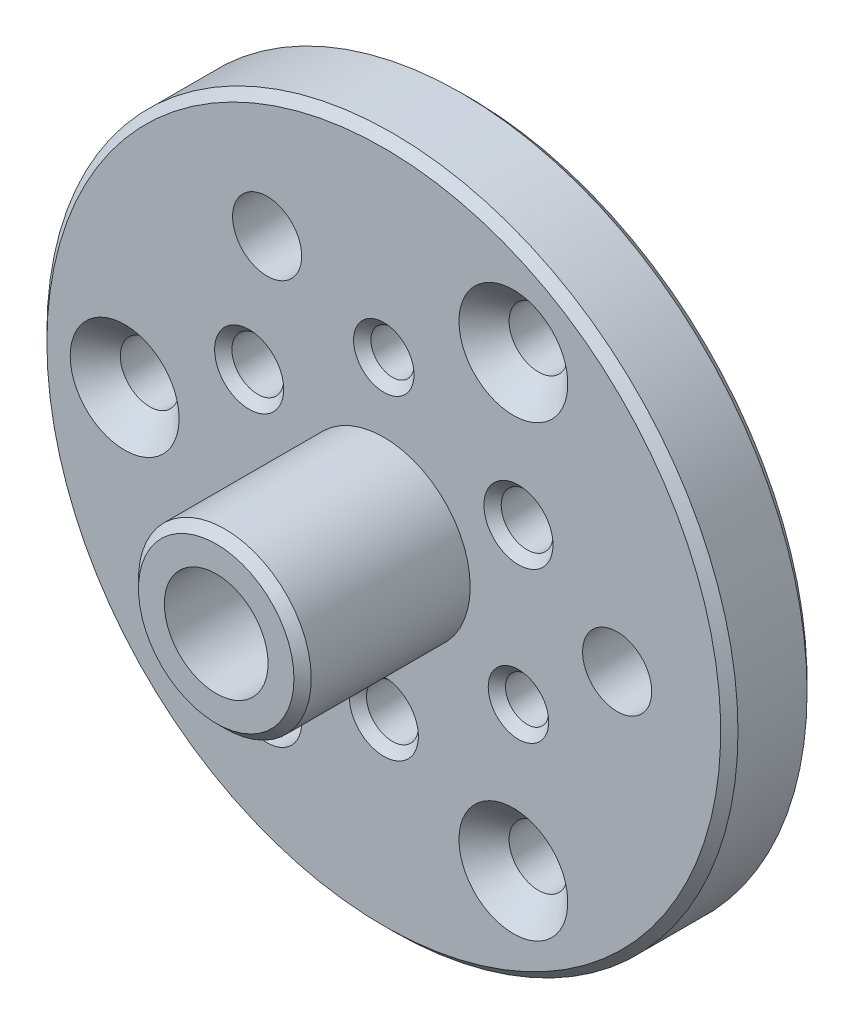
ISO-10303-21;
HEADER;
FILE_DESCRIPTION(('STEP AP214'),'2;1');
FILE_NAME('part.step','',(''),(''),'','','');
FILE_SCHEMA(('AUTOMOTIVE_DESIGN { 1 0 10303 214 1 1 1 1 }'));
ENDSEC;
DATA;
#1=APPLICATION_CONTEXT('core data for automotive mechanical design processes');
#2=APPLICATION_PROTOCOL_DEFINITION('international standard','automotive_design',2000,#1);
#3=PRODUCT_CONTEXT('',#1,'mechanical');
#4=PRODUCT('Part','Part','',(#3));
#5=PRODUCT_RELATED_PRODUCT_CATEGORY('part','',(#4));
#6=PRODUCT_DEFINITION_FORMATION('','',#4);
#7=PRODUCT_DEFINITION_CONTEXT('part definition',#1,'design');
#8=PRODUCT_DEFINITION('design','',#6,#7);
#9=PRODUCT_DEFINITION_SHAPE('','',#8);
#10=(LENGTH_UNIT() NAMED_UNIT(*) SI_UNIT(.MILLI.,.METRE.));
#11=(NAMED_UNIT(*) PLANE_ANGLE_UNIT() SI_UNIT($,.RADIAN.));
#12=(NAMED_UNIT(*) SI_UNIT($,.STERADIAN.) SOLID_ANGLE_UNIT());
#13=UNCERTAINTY_MEASURE_WITH_UNIT(LENGTH_MEASURE(1.E-05),#10,'distance_accuracy_value','');
#14=(GEOMETRIC_REPRESENTATION_CONTEXT(3) GLOBAL_UNCERTAINTY_ASSIGNED_CONTEXT((#13)) GLOBAL_UNIT_ASSIGNED_CONTEXT((#10,
#11,#12)) REPRESENTATION_CONTEXT('',''));
#15=CARTESIAN_POINT('',(0.,0.,0.));
#16=DIRECTION('',(0.,0.,1.));
#17=DIRECTION('',(1.,0.,0.));
#18=AXIS2_PLACEMENT_3D('',#15,#16,#17);
#19=CARTESIAN_POINT('',(0.,0.,5.));
#20=DIRECTION('',(0.,0.,-1.));
#21=DIRECTION('',(-1.,0.,0.));
#22=AXIS2_PLACEMENT_3D('',#19,#20,#21);
#23=PLANE('',#22);
#24=CARTESIAN_POINT('',(0.,0.,5.));
#25=DIRECTION('',(0.,0.,-1.));
#26=DIRECTION('',(-1.,0.,0.));
#27=AXIS2_PLACEMENT_3D('',#24,#25,#26);
#28=CIRCLE('',#27,19.5);
#29=CARTESIAN_POINT('',(-19.5,0.,5.));
#30=VERTEX_POINT('',#29);
#31=EDGE_CURVE('E22',#30,#30,#28,.F.);
#32=ORIENTED_EDGE('',*,*,#31,.T.);
#33=EDGE_LOOP('',(#32));
#34=FACE_BOUND('',#33,.T.);
#35=CARTESIAN_POINT('',(-6.7525,-11.6956730781088,5.));
#36=DIRECTION('',(0.,0.,1.));
#37=DIRECTION('',(1.,0.,0.));
#38=AXIS2_PLACEMENT_3D('',#35,#36,#37);
#39=CIRCLE('',#38,2.);
#40=CARTESIAN_POINT('',(-4.7525,-11.6956730781088,5.));
#41=VERTEX_POINT('',#40);
#42=EDGE_CURVE('E155',#41,#41,#39,.T.);
#43=ORIENTED_EDGE('',*,*,#42,.F.);
#44=EDGE_LOOP('',(#43));
#45=FACE_BOUND('',#44,.T.);
#46=CARTESIAN_POINT('',(-6.7525,11.6956730781089,5.));
#47=DIRECTION('',(0.,0.,1.));
#48=DIRECTION('',(1.,0.,0.));
#49=AXIS2_PLACEMENT_3D('',#46,#47,#48);
#50=CIRCLE('',#49,2.);
#51=CARTESIAN_POINT('',(-4.7525,11.6956730781089,5.));
#52=VERTEX_POINT('',#51);
#53=EDGE_CURVE('E152',#52,#52,#50,.T.);
#54=ORIENTED_EDGE('',*,*,#53,.F.);
#55=EDGE_LOOP('',(#54));
#56=FACE_BOUND('',#55,.T.);
#57=CARTESIAN_POINT('',(13.505,0.,5.));
#58=DIRECTION('',(0.,0.,1.));
#59=DIRECTION('',(1.,0.,0.));
#60=AXIS2_PLACEMENT_3D('',#57,#58,#59);
#61=CIRCLE('',#60,2.);
#62=CARTESIAN_POINT('',(15.505,0.,5.));
#63=VERTEX_POINT('',#62);
#64=EDGE_CURVE('E76',#63,#63,#61,.T.);
#65=ORIENTED_EDGE('',*,*,#64,.F.);
#66=EDGE_LOOP('',(#65));
#67=FACE_BOUND('',#66,.T.);
#68=CARTESIAN_POINT('',(7.79422863405997,4.5,5.));
#69=DIRECTION('',(0.,0.,-1.));
#70=DIRECTION('',(-1.,0.,0.));
#71=AXIS2_PLACEMENT_3D('',#68,#69,#70);
#72=CIRCLE('',#71,2.);
#73=CARTESIAN_POINT('',(5.79422863405997,4.5,5.));
#74=VERTEX_POINT('',#73);
#75=EDGE_CURVE('E62',#74,#74,#72,.T.);
#76=ORIENTED_EDGE('',*,*,#75,.T.);
#77=EDGE_LOOP('',(#76));
#78=FACE_BOUND('',#77,.T.);
#79=CARTESIAN_POINT('',(0.,-9.,5.));
#80=DIRECTION('',(0.,0.,-1.));
#81=DIRECTION('',(-1.,0.,0.));
#82=AXIS2_PLACEMENT_3D('',#79,#80,#81);
#83=CIRCLE('',#82,2.);
#84=CARTESIAN_POINT('',(-2.00000000000007,-9.,5.));
#85=VERTEX_POINT('',#84);
#86=EDGE_CURVE('E65',#85,#85,#83,.T.);
#87=ORIENTED_EDGE('',*,*,#86,.T.);
#88=EDGE_LOOP('',(#87));
#89=FACE_BOUND('',#88,.T.);
#90=CARTESIAN_POINT('',(-7.79422863405992,4.5,5.));
#91=DIRECTION('',(0.,0.,-1.));
#92=DIRECTION('',(-1.,0.,0.));
#93=AXIS2_PLACEMENT_3D('',#90,#91,#92);
#94=CIRCLE('',#93,2.);
#95=CARTESIAN_POINT('',(-9.79422863405992,4.5,5.));
#96=VERTEX_POINT('',#95);
#97=EDGE_CURVE('E68',#96,#96,#94,.T.);
#98=ORIENTED_EDGE('',*,*,#97,.T.);
#99=EDGE_LOOP('',(#98));
#100=FACE_BOUND('',#99,.T.);
#101=CARTESIAN_POINT('',(7.79422863405993,-4.5,5.));
#102=DIRECTION('',(0.,0.,-1.));
#103=DIRECTION('',(-1.,0.,0.));
#104=AXIS2_PLACEMENT_3D('',#101,#102,#103);
#105=CIRCLE('',#104,1.75);
#106=CARTESIAN_POINT('',(6.04422863405993,-4.5,5.));
#107=VERTEX_POINT('',#106);
#108=EDGE_CURVE('E85',#107,#107,#105,.T.);
#109=ORIENTED_EDGE('',*,*,#108,.T.);
#110=EDGE_LOOP('',(#109));
#111=FACE_BOUND('',#110,.T.);
#112=CARTESIAN_POINT('',(-7.79422863405996,-4.5,5.));
#113=DIRECTION('',(0.,0.,-1.));
#114=DIRECTION('',(-1.,0.,0.));
#115=AXIS2_PLACEMENT_3D('',#112,#113,#114);
#116=CIRCLE('',#115,1.75);
#117=CARTESIAN_POINT('',(-9.54422863405996,-4.5,5.));
#118=VERTEX_POINT('',#117);
#119=EDGE_CURVE('E94',#118,#118,#116,.T.);
#120=ORIENTED_EDGE('',*,*,#119,.T.);
#121=EDGE_LOOP('',(#120));
#122=FACE_BOUND('',#121,.T.);
#123=CARTESIAN_POINT('',(0.,9.,5.));
#124=DIRECTION('',(0.,0.,-1.));
#125=DIRECTION('',(-1.,0.,0.));
#126=AXIS2_PLACEMENT_3D('',#123,#124,#125);
#127=CIRCLE('',#126,1.75);
#128=CARTESIAN_POINT('',(-1.74999999999999,9.,5.));
#129=VERTEX_POINT('',#128);
#130=EDGE_CURVE('E103',#129,#129,#127,.T.);
#131=ORIENTED_EDGE('',*,*,#130,.T.);
#132=EDGE_LOOP('',(#131));
#133=FACE_BOUND('',#132,.T.);
#134=CARTESIAN_POINT('',(-15.,0.,5.));
#135=DIRECTION('',(0.,0.,-1.));
#136=DIRECTION('',(-1.,0.,0.));
#137=AXIS2_PLACEMENT_3D('',#134,#135,#136);
#138=CIRCLE('',#137,3.15);
#139=CARTESIAN_POINT('',(-18.15,0.,5.));
#140=VERTEX_POINT('',#139);
#141=EDGE_CURVE('E109',#140,#140,#138,.T.);
#142=ORIENTED_EDGE('',*,*,#141,.T.);
#143=EDGE_LOOP('',(#142));
#144=FACE_BOUND('',#143,.T.);
#145=CARTESIAN_POINT('',(7.5,-12.9903810567666,5.));
#146=DIRECTION('',(0.,0.,-1.));
#147=DIRECTION('',(-1.,0.,0.));
#148=AXIS2_PLACEMENT_3D('',#145,#146,#147);
#149=CIRCLE('',#148,3.15);
#150=CARTESIAN_POINT('',(4.35,-12.9903810567666,5.));
#151=VERTEX_POINT('',#150);
#152=EDGE_CURVE('E113',#151,#151,#149,.T.);
#153=ORIENTED_EDGE('',*,*,#152,.T.);
#154=EDGE_LOOP('',(#153));
#155=FACE_BOUND('',#154,.T.);
#156=CARTESIAN_POINT('',(7.5,12.9903810567666,5.));
#157=DIRECTION('',(0.,0.,-1.));
#158=DIRECTION('',(-1.,0.,0.));
#159=AXIS2_PLACEMENT_3D('',#156,#157,#158);
#160=CIRCLE('',#159,3.15);
#161=CARTESIAN_POINT('',(4.35,12.9903810567666,5.));
#162=VERTEX_POINT('',#161);
#163=EDGE_CURVE('E118',#162,#162,#160,.T.);
#164=ORIENTED_EDGE('',*,*,#163,.T.);
#165=EDGE_LOOP('',(#164));
#166=FACE_BOUND('',#165,.T.);
#167=CARTESIAN_POINT('',(0.,0.,5.));
#168=DIRECTION('',(0.,0.,1.));
#169=DIRECTION('',(1.,0.,0.));
#170=AXIS2_PLACEMENT_3D('',#167,#168,#169);
#171=CIRCLE('',#170,5.);
#172=CARTESIAN_POINT('',(5.,0.,5.));
#173=VERTEX_POINT('',#172);
#174=EDGE_CURVE('E131',#173,#173,#171,.T.);
#175=ORIENTED_EDGE('',*,*,#174,.F.);
#176=EDGE_LOOP('',(#175));
#177=FACE_BOUND('',#176,.T.);
#178=ADVANCED_FACE('F15',(#34,#45,#56,#67,#78,#89,#100,#111,#122,#133,#144,#155,#166,#177),#23,.F.);
#179=CARTESIAN_POINT('',(0.,0.,4.));
#180=DIRECTION('',(0.,0.,-1.));
#181=DIRECTION('',(-1.,0.,0.));
#182=AXIS2_PLACEMENT_3D('',#179,#180,#181);
#183=CYLINDRICAL_SURFACE('',#182,20.);
#184=CARTESIAN_POINT('',(0.,0.,4.5));
#185=DIRECTION('',(0.,0.,-1.));
#186=DIRECTION('',(-1.,0.,0.));
#187=AXIS2_PLACEMENT_3D('',#184,#185,#186);
#188=CIRCLE('',#187,20.);
#189=CARTESIAN_POINT('',(-20.,0.,4.5));
#190=VERTEX_POINT('',#189);
#191=EDGE_CURVE('E26',#190,#190,#188,.T.);
#192=ORIENTED_EDGE('',*,*,#191,.T.);
#193=EDGE_LOOP('',(#192));
#194=FACE_BOUND('',#193,.T.);
#195=CARTESIAN_POINT('',(0.,0.,0.5));
#196=DIRECTION('',(0.,0.,-1.));
#197=DIRECTION('',(-1.,0.,0.));
#198=AXIS2_PLACEMENT_3D('',#195,#196,#197);
#199=CIRCLE('',#198,20.);
#200=CARTESIAN_POINT('',(-20.,0.,0.5));
#201=VERTEX_POINT('',#200);
#202=EDGE_CURVE('E30',#201,#201,#199,.F.);
#203=ORIENTED_EDGE('',*,*,#202,.T.);
#204=EDGE_LOOP('',(#203));
#205=FACE_BOUND('',#204,.T.);
#206=ADVANCED_FACE('F163',(#194,#205),#183,.T.);
#207=CARTESIAN_POINT('',(0.,0.,0.));
#208=DIRECTION('',(0.,0.,-1.));
#209=DIRECTION('',(-1.,0.,0.));
#210=AXIS2_PLACEMENT_3D('',#207,#208,#209);
#211=PLANE('',#210);
#212=CARTESIAN_POINT('',(0.,0.,0.));
#213=DIRECTION('',(0.,0.,-1.));
#214=DIRECTION('',(-1.,0.,0.));
#215=AXIS2_PLACEMENT_3D('',#212,#213,#214);
#216=CIRCLE('',#215,19.5);
#217=CARTESIAN_POINT('',(-19.5,0.,0.));
#218=VERTEX_POINT('',#217);
#219=EDGE_CURVE('E10',#218,#218,#216,.T.);
#220=ORIENTED_EDGE('',*,*,#219,.T.);
#221=EDGE_LOOP('',(#220));
#222=FACE_BOUND('',#221,.T.);
#223=CARTESIAN_POINT('',(-6.7525,-11.6956730781088,0.));
#224=DIRECTION('',(0.,0.,-1.));
#225=DIRECTION('',(-1.,0.,0.));
#226=AXIS2_PLACEMENT_3D('',#223,#224,#225);
#227=CIRCLE('',#226,2.5);
#228=CARTESIAN_POINT('',(-9.2525,-11.6956730781088,0.));
#229=VERTEX_POINT('',#228);
#230=EDGE_CURVE('E38',#229,#229,#227,.F.);
#231=ORIENTED_EDGE('',*,*,#230,.T.);
#232=EDGE_LOOP('',(#231));
#233=FACE_BOUND('',#232,.T.);
#234=CARTESIAN_POINT('',(-6.7525,11.6956730781089,0.));
#235=DIRECTION('',(0.,0.,-1.));
#236=DIRECTION('',(-1.,0.,0.));
#237=AXIS2_PLACEMENT_3D('',#234,#235,#236);
#238=CIRCLE('',#237,2.5);
#239=CARTESIAN_POINT('',(-9.2525,11.6956730781089,0.));
#240=VERTEX_POINT('',#239);
#241=EDGE_CURVE('E44',#240,#240,#238,.F.);
#242=ORIENTED_EDGE('',*,*,#241,.T.);
#243=EDGE_LOOP('',(#242));
#244=FACE_BOUND('',#243,.T.);
#245=CARTESIAN_POINT('',(13.505,0.,0.));
#246=DIRECTION('',(0.,0.,-1.));
#247=DIRECTION('',(-1.,0.,0.));
#248=AXIS2_PLACEMENT_3D('',#245,#246,#247);
#249=CIRCLE('',#248,2.5);
#250=CARTESIAN_POINT('',(11.005,0.,0.));
#251=VERTEX_POINT('',#250);
#252=EDGE_CURVE('E50',#251,#251,#249,.F.);
#253=ORIENTED_EDGE('',*,*,#252,.T.);
#254=EDGE_LOOP('',(#253));
#255=FACE_BOUND('',#254,.T.);
#256=CARTESIAN_POINT('',(0.,-9.,0.));
#257=DIRECTION('',(0.,0.,-1.));
#258=DIRECTION('',(-1.,0.,0.));
#259=AXIS2_PLACEMENT_3D('',#256,#257,#258);
#260=CIRCLE('',#259,1.5);
#261=CARTESIAN_POINT('',(-1.50000000000007,-9.,0.));
#262=VERTEX_POINT('',#261);
#263=EDGE_CURVE('E72',#262,#262,#260,.T.);
#264=ORIENTED_EDGE('',*,*,#263,.F.);
#265=EDGE_LOOP('',(#264));
#266=FACE_BOUND('',#265,.T.);
#267=CARTESIAN_POINT('',(-7.79422863405992,4.5,0.));
#268=DIRECTION('',(0.,0.,-1.));
#269=DIRECTION('',(-1.,0.,0.));
#270=AXIS2_PLACEMENT_3D('',#267,#268,#269);
#271=CIRCLE('',#270,1.5);
#272=CARTESIAN_POINT('',(-9.29422863405992,4.5,0.));
#273=VERTEX_POINT('',#272);
#274=EDGE_CURVE('E75',#273,#273,#271,.T.);
#275=ORIENTED_EDGE('',*,*,#274,.F.);
#276=EDGE_LOOP('',(#275));
#277=FACE_BOUND('',#276,.T.);
#278=CARTESIAN_POINT('',(7.79422863405997,4.5,0.));
#279=DIRECTION('',(0.,0.,-1.));
#280=DIRECTION('',(-1.,0.,0.));
#281=AXIS2_PLACEMENT_3D('',#278,#279,#280);
#282=CIRCLE('',#281,1.5);
#283=CARTESIAN_POINT('',(6.29422863405997,4.5,0.));
#284=VERTEX_POINT('',#283);
#285=EDGE_CURVE('E79',#284,#284,#282,.T.);
#286=ORIENTED_EDGE('',*,*,#285,.F.);
#287=EDGE_LOOP('',(#286));
#288=FACE_BOUND('',#287,.T.);
#289=CARTESIAN_POINT('',(7.79422863405993,-4.5,0.));
#290=DIRECTION('',(0.,0.,-1.));
#291=DIRECTION('',(-1.,0.,0.));
#292=AXIS2_PLACEMENT_3D('',#289,#290,#291);
#293=CIRCLE('',#292,1.25);
#294=CARTESIAN_POINT('',(6.54422863405993,-4.5,0.));
#295=VERTEX_POINT('',#294);
#296=EDGE_CURVE('E82',#295,#295,#293,.T.);
#297=ORIENTED_EDGE('',*,*,#296,.F.);
#298=EDGE_LOOP('',(#297));
#299=FACE_BOUND('',#298,.T.);
#300=CARTESIAN_POINT('',(-7.79422863405996,-4.5,0.));
#301=DIRECTION('',(0.,0.,-1.));
#302=DIRECTION('',(-1.,0.,0.));
#303=AXIS2_PLACEMENT_3D('',#300,#301,#302);
#304=CIRCLE('',#303,1.25);
#305=CARTESIAN_POINT('',(-9.04422863405996,-4.5,0.));
#306=VERTEX_POINT('',#305);
#307=EDGE_CURVE('E91',#306,#306,#304,.T.);
#308=ORIENTED_EDGE('',*,*,#307,.F.);
#309=EDGE_LOOP('',(#308));
#310=FACE_BOUND('',#309,.T.);
#311=CARTESIAN_POINT('',(0.,9.,0.));
#312=DIRECTION('',(0.,0.,-1.));
#313=DIRECTION('',(-1.,0.,0.));
#314=AXIS2_PLACEMENT_3D('',#311,#312,#313);
#315=CIRCLE('',#314,1.25);
#316=CARTESIAN_POINT('',(-1.24999999999999,9.,0.));
#317=VERTEX_POINT('',#316);
#318=EDGE_CURVE('E100',#317,#317,#315,.T.);
#319=ORIENTED_EDGE('',*,*,#318,.F.);
#320=EDGE_LOOP('',(#319));
#321=FACE_BOUND('',#320,.T.);
#322=CARTESIAN_POINT('',(-15.,0.,0.));
#323=DIRECTION('',(0.,0.,-1.));
#324=DIRECTION('',(-1.,0.,0.));
#325=AXIS2_PLACEMENT_3D('',#322,#323,#324);
#326=CIRCLE('',#325,1.7);
#327=CARTESIAN_POINT('',(-16.7,0.,0.));
#328=VERTEX_POINT('',#327);
#329=EDGE_CURVE('E110',#328,#328,#326,.T.);
#330=ORIENTED_EDGE('',*,*,#329,.F.);
#331=EDGE_LOOP('',(#330));
#332=FACE_BOUND('',#331,.T.);
#333=CARTESIAN_POINT('',(7.5,-12.9903810567666,0.));
#334=DIRECTION('',(0.,0.,-1.));
#335=DIRECTION('',(-1.,0.,0.));
#336=AXIS2_PLACEMENT_3D('',#333,#334,#335);
#337=CIRCLE('',#336,1.7);
#338=CARTESIAN_POINT('',(5.8,-12.9903810567666,0.));
#339=VERTEX_POINT('',#338);
#340=EDGE_CURVE('E115',#339,#339,#337,.T.);
#341=ORIENTED_EDGE('',*,*,#340,.F.);
#342=EDGE_LOOP('',(#341));
#343=FACE_BOUND('',#342,.T.);
#344=CARTESIAN_POINT('',(7.5,12.9903810567666,0.));
#345=DIRECTION('',(0.,0.,-1.));
#346=DIRECTION('',(-1.,0.,0.));
#347=AXIS2_PLACEMENT_3D('',#344,#345,#346);
#348=CIRCLE('',#347,1.7);
#349=CARTESIAN_POINT('',(5.8,12.9903810567666,0.));
#350=VERTEX_POINT('',#349);
#351=EDGE_CURVE('E120',#350,#350,#348,.T.);
#352=ORIENTED_EDGE('',*,*,#351,.F.);
#353=EDGE_LOOP('',(#352));
#354=FACE_BOUND('',#353,.T.);
#355=CARTESIAN_POINT('',(0.,0.,0.));
#356=DIRECTION('',(0.,0.,-1.));
#357=DIRECTION('',(-1.,0.,0.));
#358=AXIS2_PLACEMENT_3D('',#355,#356,#357);
#359=CIRCLE('',#358,3.);
#360=CARTESIAN_POINT('',(-3.,0.,0.));
#361=VERTEX_POINT('',#360);
#362=EDGE_CURVE('E123',#361,#361,#359,.T.);
#363=ORIENTED_EDGE('',*,*,#362,.F.);
#364=EDGE_LOOP('',(#363));
#365=FACE_BOUND('',#364,.T.);
#366=ADVANCED_FACE('F192',(#222,#233,#244,#255,#266,#277,#288,#299,#310,#321,#332,#343,#354,
#365),#211,.T.);
#367=CARTESIAN_POINT('',(0.,0.,13.7));
#368=DIRECTION('',(0.,0.,-1.));
#369=DIRECTION('',(-1.,0.,0.));
#370=AXIS2_PLACEMENT_3D('',#367,#368,#369);
#371=CYLINDRICAL_SURFACE('',#370,5.);
#372=CARTESIAN_POINT('',(0.,0.,14.2));
#373=DIRECTION('',(0.,0.,1.));
#374=DIRECTION('',(1.,0.,0.));
#375=AXIS2_PLACEMENT_3D('',#372,#373,#374);
#376=CIRCLE('',#375,5.);
#377=CARTESIAN_POINT('',(5.,0.,14.2));
#378=VERTEX_POINT('',#377);
#379=EDGE_CURVE('E106',#378,#378,#376,.F.);
#380=ORIENTED_EDGE('',*,*,#379,.T.);
#381=EDGE_LOOP('',(#380));
#382=FACE_BOUND('',#381,.T.);
#383=ORIENTED_EDGE('',*,*,#174,.T.);
#384=EDGE_LOOP('',(#383));
#385=FACE_BOUND('',#384,.T.);
#386=ADVANCED_FACE('F189',(#382,#385),#371,.T.);
#387=CARTESIAN_POINT('',(0.,0.,13.7));
#388=DIRECTION('',(0.,0.,-1.));
#389=DIRECTION('',(-1.,0.,0.));
#390=AXIS2_PLACEMENT_3D('',#387,#388,#389);
#391=CYLINDRICAL_SURFACE('',#390,3.);
#392=CARTESIAN_POINT('',(0.,0.,14.7));
#393=DIRECTION('',(0.,0.,1.));
#394=DIRECTION('',(1.,0.,0.));
#395=AXIS2_PLACEMENT_3D('',#392,#393,#394);
#396=CIRCLE('',#395,3.);
#397=CARTESIAN_POINT('',(3.,0.,14.7));
#398=VERTEX_POINT('',#397);
#399=EDGE_CURVE('E128',#398,#398,#396,.T.);
#400=ORIENTED_EDGE('',*,*,#399,.T.);
#401=EDGE_LOOP('',(#400));
#402=FACE_BOUND('',#401,.T.);
#403=ORIENTED_EDGE('',*,*,#362,.T.);
#404=EDGE_LOOP('',(#403));
#405=FACE_BOUND('',#404,.T.);
#406=ADVANCED_FACE('F191',(#402,#405),#391,.F.);
#407=CARTESIAN_POINT('',(0.,0.,14.7));
#408=DIRECTION('',(0.,0.,1.));
#409=DIRECTION('',(1.,0.,0.));
#410=AXIS2_PLACEMENT_3D('',#407,#408,#409);
#411=PLANE('',#410);
#412=CARTESIAN_POINT('',(0.,0.,14.7));
#413=DIRECTION('',(0.,0.,1.));
#414=DIRECTION('',(1.,0.,0.));
#415=AXIS2_PLACEMENT_3D('',#412,#413,#414);
#416=CIRCLE('',#415,4.5);
#417=CARTESIAN_POINT('',(4.5,0.,14.7));
#418=VERTEX_POINT('',#417);
#419=EDGE_CURVE('E127',#418,#418,#416,.T.);
#420=ORIENTED_EDGE('',*,*,#419,.T.);
#421=EDGE_LOOP('',(#420));
#422=FACE_BOUND('',#421,.T.);
#423=ORIENTED_EDGE('',*,*,#399,.F.);
#424=EDGE_LOOP('',(#423));
#425=FACE_BOUND('',#424,.T.);
#426=ADVANCED_FACE('F200',(#422,#425),#411,.T.);
#427=CARTESIAN_POINT('',(0.,0.,14.7));
#428=DIRECTION('',(0.,0.,-1.));
#429=DIRECTION('',(-1.,0.,0.));
#430=AXIS2_PLACEMENT_3D('',#427,#428,#429);
#431=CONICAL_SURFACE('',#430,4.5,0.785398163397448);
#432=ORIENTED_EDGE('',*,*,#379,.F.);
#433=EDGE_LOOP('',(#432));
#434=FACE_BOUND('',#433,.T.);
#435=ORIENTED_EDGE('',*,*,#419,.F.);
#436=EDGE_LOOP('',(#435));
#437=FACE_BOUND('',#436,.T.);
#438=ADVANCED_FACE('F211',(#434,#437),#431,.T.);
#439=CARTESIAN_POINT('',(7.5,12.9903810567666,-2.35));
#440=DIRECTION('',(0.,0.,-1.));
#441=DIRECTION('',(-1.,0.,0.));
#442=AXIS2_PLACEMENT_3D('',#439,#440,#441);
#443=CYLINDRICAL_SURFACE('',#442,1.7);
#444=ORIENTED_EDGE('',*,*,#351,.T.);
#445=EDGE_LOOP('',(#444));
#446=FACE_BOUND('',#445,.T.);
#447=CARTESIAN_POINT('',(7.5,12.9903810567666,3.55));
#448=DIRECTION('',(0.,0.,-1.));
#449=DIRECTION('',(-1.,0.,0.));
#450=AXIS2_PLACEMENT_3D('',#447,#448,#449);
#451=CIRCLE('',#450,1.7);
#452=CARTESIAN_POINT('',(5.8,12.9903810567666,3.55));
#453=VERTEX_POINT('',#452);
#454=EDGE_CURVE('E124',#453,#453,#451,.F.);
#455=ORIENTED_EDGE('',*,*,#454,.T.);
#456=EDGE_LOOP('',(#455));
#457=FACE_BOUND('',#456,.T.);
#458=ADVANCED_FACE('F215',(#446,#457),#443,.F.);
#459=CARTESIAN_POINT('',(7.5,12.9903810567666,5.));
#460=DIRECTION('',(0.,0.,1.));
#461=DIRECTION('',(1.,0.,0.));
#462=AXIS2_PLACEMENT_3D('',#459,#460,#461);
#463=CONICAL_SURFACE('',#462,3.15,0.785398163397448);
#464=ORIENTED_EDGE('',*,*,#454,.F.);
#465=EDGE_LOOP('',(#464));
#466=FACE_BOUND('',#465,.T.);
#467=ORIENTED_EDGE('',*,*,#163,.F.);
#468=EDGE_LOOP('',(#467));
#469=FACE_BOUND('',#468,.T.);
#470=ADVANCED_FACE('F483',(#466,#469),#463,.F.);
#471=CARTESIAN_POINT('',(7.5,-12.9903810567666,-2.35));
#472=DIRECTION('',(0.,0.,-1.));
#473=DIRECTION('',(-1.,0.,0.));
#474=AXIS2_PLACEMENT_3D('',#471,#472,#473);
#475=CYLINDRICAL_SURFACE('',#474,1.7);
#476=ORIENTED_EDGE('',*,*,#340,.T.);
#477=EDGE_LOOP('',(#476));
#478=FACE_BOUND('',#477,.T.);
#479=CARTESIAN_POINT('',(7.5,-12.9903810567666,3.55));
#480=DIRECTION('',(0.,0.,-1.));
#481=DIRECTION('',(-1.,0.,0.));
#482=AXIS2_PLACEMENT_3D('',#479,#480,#481);
#483=CIRCLE('',#482,1.7);
#484=CARTESIAN_POINT('',(5.8,-12.9903810567666,3.55));
#485=VERTEX_POINT('',#484);
#486=EDGE_CURVE('E119',#485,#485,#483,.F.);
#487=ORIENTED_EDGE('',*,*,#486,.T.);
#488=EDGE_LOOP('',(#487));
#489=FACE_BOUND('',#488,.T.);
#490=ADVANCED_FACE('F472',(#478,#489),#475,.F.);
#491=CARTESIAN_POINT('',(7.5,-12.9903810567666,5.));
#492=DIRECTION('',(0.,0.,1.));
#493=DIRECTION('',(1.,0.,0.));
#494=AXIS2_PLACEMENT_3D('',#491,#492,#493);
#495=CONICAL_SURFACE('',#494,3.15,0.785398163397448);
#496=ORIENTED_EDGE('',*,*,#486,.F.);
#497=EDGE_LOOP('',(#496));
#498=FACE_BOUND('',#497,.T.);
#499=ORIENTED_EDGE('',*,*,#152,.F.);
#500=EDGE_LOOP('',(#499));
#501=FACE_BOUND('',#500,.T.);
#502=ADVANCED_FACE('F461',(#498,#501),#495,.F.);
#503=CARTESIAN_POINT('',(-15.,0.,-2.35));
#504=DIRECTION('',(0.,0.,-1.));
#505=DIRECTION('',(-1.,0.,0.));
#506=AXIS2_PLACEMENT_3D('',#503,#504,#505);
#507=CYLINDRICAL_SURFACE('',#506,1.7);
#508=ORIENTED_EDGE('',*,*,#329,.T.);
#509=EDGE_LOOP('',(#508));
#510=FACE_BOUND('',#509,.T.);
#511=CARTESIAN_POINT('',(-15.,0.,3.55));
#512=DIRECTION('',(0.,0.,-1.));
#513=DIRECTION('',(-1.,0.,0.));
#514=AXIS2_PLACEMENT_3D('',#511,#512,#513);
#515=CIRCLE('',#514,1.7);
#516=CARTESIAN_POINT('',(-16.7,0.,3.55));
#517=VERTEX_POINT('',#516);
#518=EDGE_CURVE('E114',#517,#517,#515,.F.);
#519=ORIENTED_EDGE('',*,*,#518,.T.);
#520=EDGE_LOOP('',(#519));
#521=FACE_BOUND('',#520,.T.);
#522=ADVANCED_FACE('F450',(#510,#521),#507,.F.);
#523=CARTESIAN_POINT('',(-15.,0.,5.));
#524=DIRECTION('',(0.,0.,1.));
#525=DIRECTION('',(1.,0.,0.));
#526=AXIS2_PLACEMENT_3D('',#523,#524,#525);
#527=CONICAL_SURFACE('',#526,3.15,0.785398163397448);
#528=ORIENTED_EDGE('',*,*,#518,.F.);
#529=EDGE_LOOP('',(#528));
#530=FACE_BOUND('',#529,.T.);
#531=ORIENTED_EDGE('',*,*,#141,.F.);
#532=EDGE_LOOP('',(#531));
#533=FACE_BOUND('',#532,.T.);
#534=ADVANCED_FACE('F439',(#530,#533),#527,.F.);
#535=CARTESIAN_POINT('',(0.,9.,5.));
#536=DIRECTION('',(0.,0.,-1.));
#537=DIRECTION('',(-1.,0.,0.));
#538=AXIS2_PLACEMENT_3D('',#535,#536,#537);
#539=CYLINDRICAL_SURFACE('',#538,1.25);
#540=CARTESIAN_POINT('',(0.,9.,4.5));
#541=DIRECTION('',(0.,0.,-1.));
#542=DIRECTION('',(-1.,0.,0.));
#543=AXIS2_PLACEMENT_3D('',#540,#541,#542);
#544=CIRCLE('',#543,1.25);
#545=CARTESIAN_POINT('',(-1.24999999999999,9.,4.5));
#546=VERTEX_POINT('',#545);
#547=EDGE_CURVE('E97',#546,#546,#544,.F.);
#548=ORIENTED_EDGE('',*,*,#547,.T.);
#549=EDGE_LOOP('',(#548));
#550=FACE_BOUND('',#549,.T.);
#551=ORIENTED_EDGE('',*,*,#318,.T.);
#552=EDGE_LOOP('',(#551));
#553=FACE_BOUND('',#552,.T.);
#554=ADVANCED_FACE('F221',(#550,#553),#539,.F.);
#555=CARTESIAN_POINT('',(0.,9.,5.));
#556=DIRECTION('',(0.,0.,1.));
#557=DIRECTION('',(1.,0.,0.));
#558=AXIS2_PLACEMENT_3D('',#555,#556,#557);
#559=CONICAL_SURFACE('',#558,1.75,0.785398163397449);
#560=ORIENTED_EDGE('',*,*,#547,.F.);
#561=EDGE_LOOP('',(#560));
#562=FACE_BOUND('',#561,.T.);
#563=ORIENTED_EDGE('',*,*,#130,.F.);
#564=EDGE_LOOP('',(#563));
#565=FACE_BOUND('',#564,.T.);
#566=ADVANCED_FACE('F217',(#562,#565),#559,.F.);
#567=CARTESIAN_POINT('',(-7.79422863405996,-4.5,5.));
#568=DIRECTION('',(0.,0.,-1.));
#569=DIRECTION('',(-1.,0.,0.));
#570=AXIS2_PLACEMENT_3D('',#567,#568,#569);
#571=CYLINDRICAL_SURFACE('',#570,1.25);
#572=CARTESIAN_POINT('',(-7.79422863405996,-4.5,4.5));
#573=DIRECTION('',(0.,0.,-1.));
#574=DIRECTION('',(-1.,0.,0.));
#575=AXIS2_PLACEMENT_3D('',#572,#573,#574);
#576=CIRCLE('',#575,1.25);
#577=CARTESIAN_POINT('',(-9.04422863405996,-4.5,4.5));
#578=VERTEX_POINT('',#577);
#579=EDGE_CURVE('E88',#578,#578,#576,.F.);
#580=ORIENTED_EDGE('',*,*,#579,.T.);
#581=EDGE_LOOP('',(#580));
#582=FACE_BOUND('',#581,.T.);
#583=ORIENTED_EDGE('',*,*,#307,.T.);
#584=EDGE_LOOP('',(#583));
#585=FACE_BOUND('',#584,.T.);
#586=ADVANCED_FACE('F220',(#582,#585),#571,.F.);
#587=CARTESIAN_POINT('',(-7.79422863405996,-4.5,5.));
#588=DIRECTION('',(0.,0.,1.));
#589=DIRECTION('',(1.,0.,0.));
#590=AXIS2_PLACEMENT_3D('',#587,#588,#589);
#591=CONICAL_SURFACE('',#590,1.75,0.785398163397449);
#592=ORIENTED_EDGE('',*,*,#579,.F.);
#593=EDGE_LOOP('',(#592));
#594=FACE_BOUND('',#593,.T.);
#595=ORIENTED_EDGE('',*,*,#119,.F.);
#596=EDGE_LOOP('',(#595));
#597=FACE_BOUND('',#596,.T.);
#598=ADVANCED_FACE('F223',(#594,#597),#591,.F.);
#599=CARTESIAN_POINT('',(7.79422863405993,-4.5,5.));
#600=DIRECTION('',(0.,0.,-1.));
#601=DIRECTION('',(-1.,0.,0.));
#602=AXIS2_PLACEMENT_3D('',#599,#600,#601);
#603=CYLINDRICAL_SURFACE('',#602,1.25);
#604=CARTESIAN_POINT('',(7.79422863405993,-4.5,4.5));
#605=DIRECTION('',(0.,0.,-1.));
#606=DIRECTION('',(-1.,0.,0.));
#607=AXIS2_PLACEMENT_3D('',#604,#605,#606);
#608=CIRCLE('',#607,1.25);
#609=CARTESIAN_POINT('',(6.54422863405993,-4.5,4.5));
#610=VERTEX_POINT('',#609);
#611=EDGE_CURVE('E71',#610,#610,#608,.F.);
#612=ORIENTED_EDGE('',*,*,#611,.T.);
#613=EDGE_LOOP('',(#612));
#614=FACE_BOUND('',#613,.T.);
#615=ORIENTED_EDGE('',*,*,#296,.T.);
#616=EDGE_LOOP('',(#615));
#617=FACE_BOUND('',#616,.T.);
#618=ADVANCED_FACE('F226',(#614,#617),#603,.F.);
#619=CARTESIAN_POINT('',(7.79422863405993,-4.5,5.));
#620=DIRECTION('',(0.,0.,1.));
#621=DIRECTION('',(1.,0.,0.));
#622=AXIS2_PLACEMENT_3D('',#619,#620,#621);
#623=CONICAL_SURFACE('',#622,1.75,0.785398163397449);
#624=ORIENTED_EDGE('',*,*,#611,.F.);
#625=EDGE_LOOP('',(#624));
#626=FACE_BOUND('',#625,.T.);
#627=ORIENTED_EDGE('',*,*,#108,.F.);
#628=EDGE_LOOP('',(#627));
#629=FACE_BOUND('',#628,.T.);
#630=ADVANCED_FACE('F228',(#626,#629),#623,.F.);
#631=CARTESIAN_POINT('',(7.79422863405997,4.5,5.));
#632=DIRECTION('',(0.,0.,-1.));
#633=DIRECTION('',(-1.,0.,0.));
#634=AXIS2_PLACEMENT_3D('',#631,#632,#633);
#635=CYLINDRICAL_SURFACE('',#634,1.5);
#636=CARTESIAN_POINT('',(7.79422863405997,4.5,4.5));
#637=DIRECTION('',(0.,0.,-1.));
#638=DIRECTION('',(-1.,0.,0.));
#639=AXIS2_PLACEMENT_3D('',#636,#637,#638);
#640=CIRCLE('',#639,1.5);
#641=CARTESIAN_POINT('',(6.29422863405997,4.5,4.5));
#642=VERTEX_POINT('',#641);
#643=EDGE_CURVE('E59',#642,#642,#640,.F.);
#644=ORIENTED_EDGE('',*,*,#643,.T.);
#645=EDGE_LOOP('',(#644));
#646=FACE_BOUND('',#645,.T.);
#647=ORIENTED_EDGE('',*,*,#285,.T.);
#648=EDGE_LOOP('',(#647));
#649=FACE_BOUND('',#648,.T.);
#650=ADVANCED_FACE('F231',(#646,#649),#635,.F.);
#651=CARTESIAN_POINT('',(-7.79422863405992,4.5,5.));
#652=DIRECTION('',(0.,0.,-1.));
#653=DIRECTION('',(-1.,0.,0.));
#654=AXIS2_PLACEMENT_3D('',#651,#652,#653);
#655=CYLINDRICAL_SURFACE('',#654,1.5);
#656=CARTESIAN_POINT('',(-7.79422863405992,4.5,4.5));
#657=DIRECTION('',(0.,0.,-1.));
#658=DIRECTION('',(-1.,0.,0.));
#659=AXIS2_PLACEMENT_3D('',#656,#657,#658);
#660=CIRCLE('',#659,1.5);
#661=CARTESIAN_POINT('',(-9.29422863405992,4.5,4.5));
#662=VERTEX_POINT('',#661);
#663=EDGE_CURVE('E53',#662,#662,#660,.F.);
#664=ORIENTED_EDGE('',*,*,#663,.T.);
#665=EDGE_LOOP('',(#664));
#666=FACE_BOUND('',#665,.T.);
#667=ORIENTED_EDGE('',*,*,#274,.T.);
#668=EDGE_LOOP('',(#667));
#669=FACE_BOUND('',#668,.T.);
#670=ADVANCED_FACE('F367',(#666,#669),#655,.F.);
#671=CARTESIAN_POINT('',(0.,-9.,5.));
#672=DIRECTION('',(0.,0.,-1.));
#673=DIRECTION('',(-1.,0.,0.));
#674=AXIS2_PLACEMENT_3D('',#671,#672,#673);
#675=CYLINDRICAL_SURFACE('',#674,1.5);
#676=CARTESIAN_POINT('',(0.,-9.,4.5));
#677=DIRECTION('',(0.,0.,-1.));
#678=DIRECTION('',(-1.,0.,0.));
#679=AXIS2_PLACEMENT_3D('',#676,#677,#678);
#680=CIRCLE('',#679,1.5);
#681=CARTESIAN_POINT('',(-1.50000000000007,-9.,4.5));
#682=VERTEX_POINT('',#681);
#683=EDGE_CURVE('E56',#682,#682,#680,.F.);
#684=ORIENTED_EDGE('',*,*,#683,.T.);
#685=EDGE_LOOP('',(#684));
#686=FACE_BOUND('',#685,.T.);
#687=ORIENTED_EDGE('',*,*,#263,.T.);
#688=EDGE_LOOP('',(#687));
#689=FACE_BOUND('',#688,.T.);
#690=ADVANCED_FACE('F237',(#686,#689),#675,.F.);
#691=CARTESIAN_POINT('',(7.79422863405997,4.5,5.));
#692=DIRECTION('',(0.,0.,1.));
#693=DIRECTION('',(1.,0.,0.));
#694=AXIS2_PLACEMENT_3D('',#691,#692,#693);
#695=CONICAL_SURFACE('',#694,2.,0.785398163397448);
#696=ORIENTED_EDGE('',*,*,#643,.F.);
#697=EDGE_LOOP('',(#696));
#698=FACE_BOUND('',#697,.T.);
#699=ORIENTED_EDGE('',*,*,#75,.F.);
#700=EDGE_LOOP('',(#699));
#701=FACE_BOUND('',#700,.T.);
#702=ADVANCED_FACE('F233',(#698,#701),#695,.F.);
#703=CARTESIAN_POINT('',(0.,-9.,5.));
#704=DIRECTION('',(0.,0.,1.));
#705=DIRECTION('',(1.,0.,0.));
#706=AXIS2_PLACEMENT_3D('',#703,#704,#705);
#707=CONICAL_SURFACE('',#706,2.,0.785398163397449);
#708=ORIENTED_EDGE('',*,*,#683,.F.);
#709=EDGE_LOOP('',(#708));
#710=FACE_BOUND('',#709,.T.);
#711=ORIENTED_EDGE('',*,*,#86,.F.);
#712=EDGE_LOOP('',(#711));
#713=FACE_BOUND('',#712,.T.);
#714=ADVANCED_FACE('F236',(#710,#713),#707,.F.);
#715=CARTESIAN_POINT('',(-7.79422863405992,4.5,5.));
#716=DIRECTION('',(0.,0.,1.));
#717=DIRECTION('',(1.,0.,0.));
#718=AXIS2_PLACEMENT_3D('',#715,#716,#717);
#719=CONICAL_SURFACE('',#718,2.,0.785398163397449);
#720=ORIENTED_EDGE('',*,*,#663,.F.);
#721=EDGE_LOOP('',(#720));
#722=FACE_BOUND('',#721,.T.);
#723=ORIENTED_EDGE('',*,*,#97,.F.);
#724=EDGE_LOOP('',(#723));
#725=FACE_BOUND('',#724,.T.);
#726=ADVANCED_FACE('F241',(#722,#725),#719,.F.);
#727=CARTESIAN_POINT('',(13.505,0.,0.));
#728=DIRECTION('',(0.,0.,1.));
#729=DIRECTION('',(1.,0.,0.));
#730=AXIS2_PLACEMENT_3D('',#727,#728,#729);
#731=CYLINDRICAL_SURFACE('',#730,2.);
#732=CARTESIAN_POINT('',(13.505,0.,0.5));
#733=DIRECTION('',(0.,0.,-1.));
#734=DIRECTION('',(-1.,0.,0.));
#735=AXIS2_PLACEMENT_3D('',#732,#733,#734);
#736=CIRCLE('',#735,2.);
#737=CARTESIAN_POINT('',(11.505,0.,0.5));
#738=VERTEX_POINT('',#737);
#739=EDGE_CURVE('E47',#738,#738,#736,.T.);
#740=ORIENTED_EDGE('',*,*,#739,.T.);
#741=EDGE_LOOP('',(#740));
#742=FACE_BOUND('',#741,.T.);
#743=ORIENTED_EDGE('',*,*,#64,.T.);
#744=EDGE_LOOP('',(#743));
#745=FACE_BOUND('',#744,.T.);
#746=ADVANCED_FACE('F245',(#742,#745),#731,.F.);
#747=CARTESIAN_POINT('',(13.505,0.,0.));
#748=DIRECTION('',(0.,0.,-1.));
#749=DIRECTION('',(-1.,0.,0.));
#750=AXIS2_PLACEMENT_3D('',#747,#748,#749);
#751=CONICAL_SURFACE('',#750,2.5,0.785398163397449);
#752=ORIENTED_EDGE('',*,*,#739,.F.);
#753=EDGE_LOOP('',(#752));
#754=FACE_BOUND('',#753,.T.);
#755=ORIENTED_EDGE('',*,*,#252,.F.);
#756=EDGE_LOOP('',(#755));
#757=FACE_BOUND('',#756,.T.);
#758=ADVANCED_FACE('F247',(#754,#757),#751,.F.);
#759=CARTESIAN_POINT('',(-6.7525,11.6956730781089,0.));
#760=DIRECTION('',(0.,0.,1.));
#761=DIRECTION('',(1.,0.,0.));
#762=AXIS2_PLACEMENT_3D('',#759,#760,#761);
#763=CYLINDRICAL_SURFACE('',#762,2.);
#764=CARTESIAN_POINT('',(-6.7525,11.6956730781089,0.5));
#765=DIRECTION('',(0.,0.,-1.));
#766=DIRECTION('',(-1.,0.,0.));
#767=AXIS2_PLACEMENT_3D('',#764,#765,#766);
#768=CIRCLE('',#767,2.);
#769=CARTESIAN_POINT('',(-8.7525,11.6956730781089,0.5));
#770=VERTEX_POINT('',#769);
#771=EDGE_CURVE('E41',#770,#770,#768,.T.);
#772=ORIENTED_EDGE('',*,*,#771,.T.);
#773=EDGE_LOOP('',(#772));
#774=FACE_BOUND('',#773,.T.);
#775=ORIENTED_EDGE('',*,*,#53,.T.);
#776=EDGE_LOOP('',(#775));
#777=FACE_BOUND('',#776,.T.);
#778=ADVANCED_FACE('F250',(#774,#777),#763,.F.);
#779=CARTESIAN_POINT('',(-6.7525,11.6956730781089,0.));
#780=DIRECTION('',(0.,0.,-1.));
#781=DIRECTION('',(-1.,0.,0.));
#782=AXIS2_PLACEMENT_3D('',#779,#780,#781);
#783=CONICAL_SURFACE('',#782,2.5,0.785398163397448);
#784=ORIENTED_EDGE('',*,*,#771,.F.);
#785=EDGE_LOOP('',(#784));
#786=FACE_BOUND('',#785,.T.);
#787=ORIENTED_EDGE('',*,*,#241,.F.);
#788=EDGE_LOOP('',(#787));
#789=FACE_BOUND('',#788,.T.);
#790=ADVANCED_FACE('F252',(#786,#789),#783,.F.);
#791=CARTESIAN_POINT('',(-6.7525,-11.6956730781088,0.));
#792=DIRECTION('',(0.,0.,1.));
#793=DIRECTION('',(1.,0.,0.));
#794=AXIS2_PLACEMENT_3D('',#791,#792,#793);
#795=CYLINDRICAL_SURFACE('',#794,2.);
#796=CARTESIAN_POINT('',(-6.7525,-11.6956730781088,0.5));
#797=DIRECTION('',(0.,0.,-1.));
#798=DIRECTION('',(-1.,0.,0.));
#799=AXIS2_PLACEMENT_3D('',#796,#797,#798);
#800=CIRCLE('',#799,2.);
#801=CARTESIAN_POINT('',(-8.7525,-11.6956730781088,0.5));
#802=VERTEX_POINT('',#801);
#803=EDGE_CURVE('E35',#802,#802,#800,.T.);
#804=ORIENTED_EDGE('',*,*,#803,.T.);
#805=EDGE_LOOP('',(#804));
#806=FACE_BOUND('',#805,.T.);
#807=ORIENTED_EDGE('',*,*,#42,.T.);
#808=EDGE_LOOP('',(#807));
#809=FACE_BOUND('',#808,.T.);
#810=ADVANCED_FACE('F159',(#806,#809),#795,.F.);
#811=CARTESIAN_POINT('',(-6.7525,-11.6956730781088,0.));
#812=DIRECTION('',(0.,0.,-1.));
#813=DIRECTION('',(-1.,0.,0.));
#814=AXIS2_PLACEMENT_3D('',#811,#812,#813);
#815=CONICAL_SURFACE('',#814,2.5,0.785398163397448);
#816=ORIENTED_EDGE('',*,*,#803,.F.);
#817=EDGE_LOOP('',(#816));
#818=FACE_BOUND('',#817,.T.);
#819=ORIENTED_EDGE('',*,*,#230,.F.);
#820=EDGE_LOOP('',(#819));
#821=FACE_BOUND('',#820,.T.);
#822=ADVANCED_FACE('F256',(#818,#821),#815,.F.);
#823=CARTESIAN_POINT('',(0.,0.,4.5));
#824=DIRECTION('',(0.,0.,-1.));
#825=DIRECTION('',(-1.,0.,0.));
#826=AXIS2_PLACEMENT_3D('',#823,#824,#825);
#827=CONICAL_SURFACE('',#826,20.,0.785398163397449);
#828=ORIENTED_EDGE('',*,*,#31,.F.);
#829=EDGE_LOOP('',(#828));
#830=FACE_BOUND('',#829,.T.);
#831=ORIENTED_EDGE('',*,*,#191,.F.);
#832=EDGE_LOOP('',(#831));
#833=FACE_BOUND('',#832,.T.);
#834=ADVANCED_FACE('F258',(#830,#833),#827,.T.);
#835=CARTESIAN_POINT('',(0.,0.,0.));
#836=DIRECTION('',(0.,0.,1.));
#837=DIRECTION('',(1.,0.,0.));
#838=AXIS2_PLACEMENT_3D('',#835,#836,#837);
#839=CONICAL_SURFACE('',#838,19.5,0.785398163397449);
#840=ORIENTED_EDGE('',*,*,#202,.F.);
#841=EDGE_LOOP('',(#840));
#842=FACE_BOUND('',#841,.T.);
#843=ORIENTED_EDGE('',*,*,#219,.F.);
#844=EDGE_LOOP('',(#843));
#845=FACE_BOUND('',#844,.T.);
#846=ADVANCED_FACE('F17',(#842,#845),#839,.T.);
#847=CLOSED_SHELL('',(#178,#206,#366,#386,#406,#426,#438,#458,#470,#490,#502,#522,#534,#554,
#566,#586,#598,#618,#630,#650,#670,#690,#702,#714,#726,#746,#758,#778,#790,#810,#822,#834,#846));
#848=MANIFOLD_SOLID_BREP('B1',#847);
#849=ADVANCED_BREP_SHAPE_REPRESENTATION('',(#18,#848),#14);
#850=SHAPE_DEFINITION_REPRESENTATION(#9,#849);
ENDSEC;
END-ISO-10303-21;
